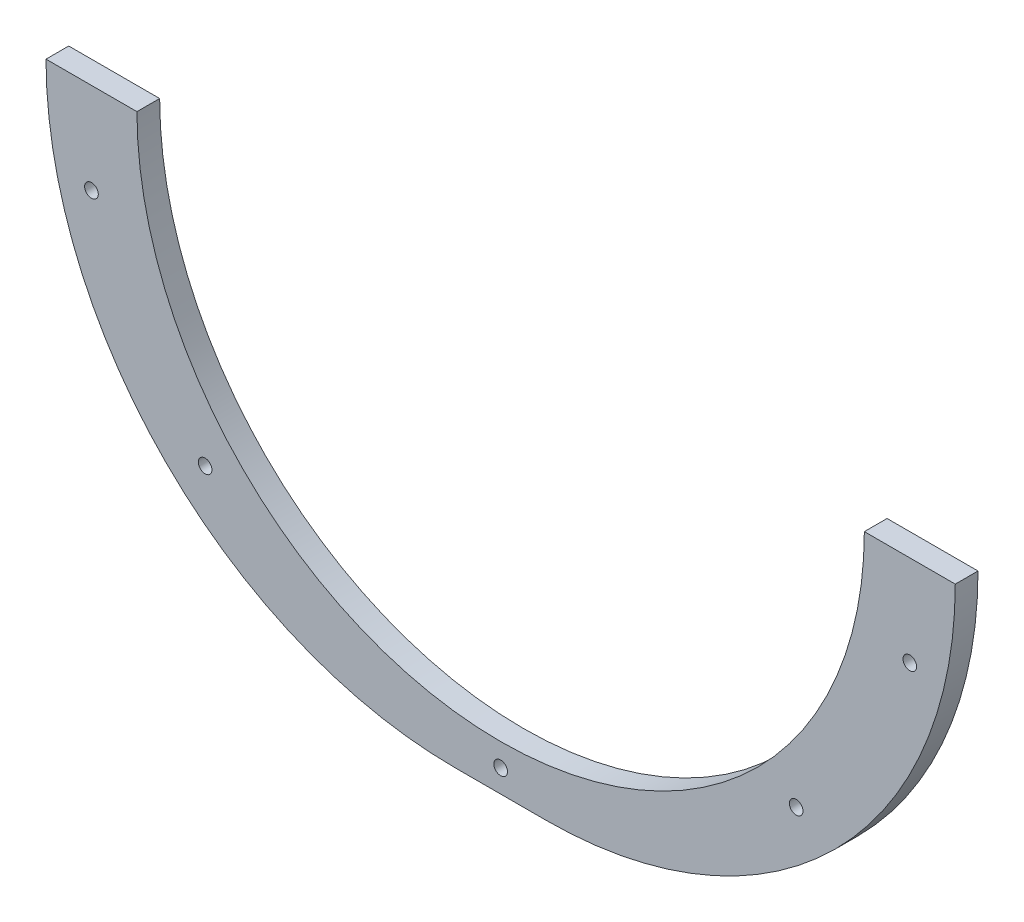
ISO-10303-21;
HEADER;
FILE_DESCRIPTION(('STEP AP214'),'2;1');
FILE_NAME('part.step','',(''),(''),'','','');
FILE_SCHEMA(('AUTOMOTIVE_DESIGN { 1 0 10303 214 1 1 1 1 }'));
ENDSEC;
DATA;
#1=APPLICATION_CONTEXT('core data for automotive mechanical design processes');
#2=APPLICATION_PROTOCOL_DEFINITION('international standard','automotive_design',2000,#1);
#3=PRODUCT_CONTEXT('',#1,'mechanical');
#4=PRODUCT('Part','Part','',(#3));
#5=PRODUCT_RELATED_PRODUCT_CATEGORY('part','',(#4));
#6=PRODUCT_DEFINITION_FORMATION('','',#4);
#7=PRODUCT_DEFINITION_CONTEXT('part definition',#1,'design');
#8=PRODUCT_DEFINITION('design','',#6,#7);
#9=PRODUCT_DEFINITION_SHAPE('','',#8);
#10=(LENGTH_UNIT() NAMED_UNIT(*) SI_UNIT(.MILLI.,.METRE.));
#11=(NAMED_UNIT(*) PLANE_ANGLE_UNIT() SI_UNIT($,.RADIAN.));
#12=(NAMED_UNIT(*) SI_UNIT($,.STERADIAN.) SOLID_ANGLE_UNIT());
#13=UNCERTAINTY_MEASURE_WITH_UNIT(LENGTH_MEASURE(1.E-05),#10,'distance_accuracy_value','');
#14=(GEOMETRIC_REPRESENTATION_CONTEXT(3) GLOBAL_UNCERTAINTY_ASSIGNED_CONTEXT((#13)) GLOBAL_UNIT_ASSIGNED_CONTEXT((#10,
#11,#12)) REPRESENTATION_CONTEXT('',''));
#15=CARTESIAN_POINT('',(0.,0.,0.));
#16=DIRECTION('',(0.,0.,1.));
#17=DIRECTION('',(1.,0.,0.));
#18=AXIS2_PLACEMENT_3D('',#15,#16,#17);
#19=CARTESIAN_POINT('',(83.4794587716096,-40.7692307692308,5.));
#20=DIRECTION('',(0.,0.,-1.));
#21=DIRECTION('',(-1.,0.,0.));
#22=AXIS2_PLACEMENT_3D('',#19,#20,#21);
#23=CYLINDRICAL_SURFACE('',#22,80.);
#24=CARTESIAN_POINT('',(83.4794587716096,-40.7692307692308,0.));
#25=DIRECTION('',(0.,0.,-1.));
#26=DIRECTION('',(1.,0.,0.));
#27=AXIS2_PLACEMENT_3D('',#24,#25,#26);
#28=CIRCLE('',#27,80.);
#29=CARTESIAN_POINT('',(163.47945877161,-40.7692307692302,0.));
#30=VERTEX_POINT('',#29);
#31=CARTESIAN_POINT('',(3.47945877160956,-40.7692307692306,0.));
#32=VERTEX_POINT('',#31);
#33=EDGE_CURVE('E120',#30,#32,#28,.T.);
#34=ORIENTED_EDGE('',*,*,#33,.T.);
#35=DIRECTION('',(0.,0.,-1.));
#36=VECTOR('',#35,1.);
#37=CARTESIAN_POINT('',(3.47945877160956,-40.7692307692306,5.));
#38=LINE('',#37,#36);
#39=CARTESIAN_POINT('',(3.47945877160956,-40.7692307692306,5.));
#40=VERTEX_POINT('',#39);
#41=EDGE_CURVE('E11',#40,#32,#38,.T.);
#42=ORIENTED_EDGE('',*,*,#41,.F.);
#43=CARTESIAN_POINT('',(83.4794587716096,-40.7692307692308,5.));
#44=DIRECTION('',(0.,0.,-1.));
#45=DIRECTION('',(1.,0.,0.));
#46=AXIS2_PLACEMENT_3D('',#43,#44,#45);
#47=CIRCLE('',#46,80.);
#48=CARTESIAN_POINT('',(163.47945877161,-40.7692307692302,5.));
#49=VERTEX_POINT('',#48);
#50=EDGE_CURVE('E131',#49,#40,#47,.T.);
#51=ORIENTED_EDGE('',*,*,#50,.F.);
#52=DIRECTION('',(0.,0.,-1.));
#53=VECTOR('',#52,1.);
#54=CARTESIAN_POINT('',(163.47945877161,-40.7692307692302,5.));
#55=LINE('',#54,#53);
#56=EDGE_CURVE('E116',#49,#30,#55,.T.);
#57=ORIENTED_EDGE('',*,*,#56,.T.);
#58=EDGE_LOOP('',(#34,#42,#51,#57));
#59=FACE_BOUND('',#58,.T.);
#60=ADVANCED_FACE('F34',(#59),#23,.F.);
#61=CARTESIAN_POINT('',(-16.5205412283876,-40.7692307692302,5.));
#62=DIRECTION('',(0.,-1.,0.));
#63=DIRECTION('',(1.,0.,0.));
#64=AXIS2_PLACEMENT_3D('',#61,#62,#63);
#65=PLANE('',#64);
#66=DIRECTION('',(-1.,0.,0.));
#67=VECTOR('',#66,1.);
#68=CARTESIAN_POINT('',(-16.5205412283876,-40.7692307692302,0.));
#69=LINE('',#68,#67);
#70=CARTESIAN_POINT('',(-16.5205412283876,-40.7692307692308,0.));
#71=VERTEX_POINT('',#70);
#72=EDGE_CURVE('E123',#32,#71,#69,.T.);
#73=ORIENTED_EDGE('',*,*,#72,.T.);
#74=DIRECTION('',(0.,0.,-1.));
#75=VECTOR('',#74,1.);
#76=CARTESIAN_POINT('',(-16.5205412283876,-40.7692307692308,5.));
#77=LINE('',#76,#75);
#78=CARTESIAN_POINT('',(-16.5205412283876,-40.7692307692308,5.));
#79=VERTEX_POINT('',#78);
#80=EDGE_CURVE('E43',#79,#71,#77,.T.);
#81=ORIENTED_EDGE('',*,*,#80,.F.);
#82=DIRECTION('',(-1.,0.,0.));
#83=VECTOR('',#82,1.);
#84=CARTESIAN_POINT('',(-16.5205412283876,-40.7692307692302,5.));
#85=LINE('',#84,#83);
#86=EDGE_CURVE('E89',#40,#79,#85,.T.);
#87=ORIENTED_EDGE('',*,*,#86,.F.);
#88=ORIENTED_EDGE('',*,*,#41,.T.);
#89=EDGE_LOOP('',(#73,#81,#87,#88));
#90=FACE_BOUND('',#89,.T.);
#91=ADVANCED_FACE('F164',(#90),#65,.F.);
#92=CARTESIAN_POINT('',(73.4794587716124,-40.7692307692308,5.));
#93=DIRECTION('',(0.,0.,-1.));
#94=DIRECTION('',(-1.,0.,0.));
#95=AXIS2_PLACEMENT_3D('',#92,#93,#94);
#96=CYLINDRICAL_SURFACE('',#95,90.);
#97=CARTESIAN_POINT('',(73.4794587716124,-40.7692307692308,0.));
#98=DIRECTION('',(0.,0.,1.));
#99=DIRECTION('',(-1.,0.,0.));
#100=AXIS2_PLACEMENT_3D('',#97,#98,#99);
#101=CIRCLE('',#100,90.);
#102=CARTESIAN_POINT('',(73.4794587716133,-130.769230769231,0.));
#103=VERTEX_POINT('',#102);
#104=EDGE_CURVE('E126',#71,#103,#101,.T.);
#105=ORIENTED_EDGE('',*,*,#104,.T.);
#106=DIRECTION('',(0.,0.,-1.));
#107=VECTOR('',#106,1.);
#108=CARTESIAN_POINT('',(73.4794587716133,-130.769230769231,5.));
#109=LINE('',#108,#107);
#110=CARTESIAN_POINT('',(73.4794587716133,-130.769230769231,5.));
#111=VERTEX_POINT('',#110);
#112=EDGE_CURVE('E111',#111,#103,#109,.T.);
#113=ORIENTED_EDGE('',*,*,#112,.F.);
#114=CARTESIAN_POINT('',(73.4794587716124,-40.7692307692308,5.));
#115=DIRECTION('',(0.,0.,1.));
#116=DIRECTION('',(-1.,0.,0.));
#117=AXIS2_PLACEMENT_3D('',#114,#115,#116);
#118=CIRCLE('',#117,90.);
#119=EDGE_CURVE('E102',#79,#111,#118,.T.);
#120=ORIENTED_EDGE('',*,*,#119,.F.);
#121=ORIENTED_EDGE('',*,*,#80,.T.);
#122=EDGE_LOOP('',(#105,#113,#120,#121));
#123=FACE_BOUND('',#122,.T.);
#124=ADVANCED_FACE('F167',(#123),#96,.T.);
#125=CARTESIAN_POINT('',(93.479458771612,-130.769230769231,5.));
#126=DIRECTION('',(0.,1.,0.));
#127=DIRECTION('',(-1.,0.,0.));
#128=AXIS2_PLACEMENT_3D('',#125,#126,#127);
#129=PLANE('',#128);
#130=DIRECTION('',(1.,0.,0.));
#131=VECTOR('',#130,1.);
#132=CARTESIAN_POINT('',(93.479458771612,-130.769230769231,0.));
#133=LINE('',#132,#131);
#134=CARTESIAN_POINT('',(93.479458771612,-130.769230769231,0.));
#135=VERTEX_POINT('',#134);
#136=EDGE_CURVE('E110',#103,#135,#133,.T.);
#137=ORIENTED_EDGE('',*,*,#136,.T.);
#138=DIRECTION('',(0.,0.,-1.));
#139=VECTOR('',#138,1.);
#140=CARTESIAN_POINT('',(93.479458771612,-130.769230769231,5.));
#141=LINE('',#140,#139);
#142=CARTESIAN_POINT('',(93.479458771612,-130.769230769231,5.));
#143=VERTEX_POINT('',#142);
#144=EDGE_CURVE('E107',#143,#135,#141,.T.);
#145=ORIENTED_EDGE('',*,*,#144,.F.);
#146=DIRECTION('',(1.,0.,0.));
#147=VECTOR('',#146,1.);
#148=CARTESIAN_POINT('',(93.479458771612,-130.769230769231,5.));
#149=LINE('',#148,#147);
#150=EDGE_CURVE('E96',#111,#143,#149,.T.);
#151=ORIENTED_EDGE('',*,*,#150,.F.);
#152=ORIENTED_EDGE('',*,*,#112,.T.);
#153=EDGE_LOOP('',(#137,#145,#151,#152));
#154=FACE_BOUND('',#153,.T.);
#155=ADVANCED_FACE('F108',(#154),#129,.F.);
#156=CARTESIAN_POINT('',(93.4794587716123,-40.7692307692307,5.));
#157=DIRECTION('',(0.,0.,-1.));
#158=DIRECTION('',(-1.,0.,0.));
#159=AXIS2_PLACEMENT_3D('',#156,#157,#158);
#160=CYLINDRICAL_SURFACE('',#159,90.);
#161=CARTESIAN_POINT('',(93.4794587716123,-40.7692307692307,0.));
#162=DIRECTION('',(0.,0.,1.));
#163=DIRECTION('',(-1.,0.,0.));
#164=AXIS2_PLACEMENT_3D('',#161,#162,#163);
#165=CIRCLE('',#164,90.);
#166=CARTESIAN_POINT('',(183.479458771612,-40.7692307692301,0.));
#167=VERTEX_POINT('',#166);
#168=EDGE_CURVE('E75',#135,#167,#165,.T.);
#169=ORIENTED_EDGE('',*,*,#168,.T.);
#170=DIRECTION('',(0.,0.,-1.));
#171=VECTOR('',#170,1.);
#172=CARTESIAN_POINT('',(183.479458771612,-40.7692307692301,5.));
#173=LINE('',#172,#171);
#174=CARTESIAN_POINT('',(183.479458771612,-40.7692307692301,5.));
#175=VERTEX_POINT('',#174);
#176=EDGE_CURVE('E112',#175,#167,#173,.T.);
#177=ORIENTED_EDGE('',*,*,#176,.F.);
#178=CARTESIAN_POINT('',(93.4794587716123,-40.7692307692307,5.));
#179=DIRECTION('',(0.,0.,1.));
#180=DIRECTION('',(-1.,0.,0.));
#181=AXIS2_PLACEMENT_3D('',#178,#179,#180);
#182=CIRCLE('',#181,90.);
#183=EDGE_CURVE('E100',#143,#175,#182,.T.);
#184=ORIENTED_EDGE('',*,*,#183,.F.);
#185=ORIENTED_EDGE('',*,*,#144,.T.);
#186=EDGE_LOOP('',(#169,#177,#184,#185));
#187=FACE_BOUND('',#186,.T.);
#188=ADVANCED_FACE('F114',(#187),#160,.T.);
#189=CARTESIAN_POINT('',(163.47945877161,-40.7692307692302,5.));
#190=DIRECTION('',(0.,-1.,0.));
#191=DIRECTION('',(1.,0.,0.));
#192=AXIS2_PLACEMENT_3D('',#189,#190,#191);
#193=PLANE('',#192);
#194=DIRECTION('',(-1.,0.,0.));
#195=VECTOR('',#194,1.);
#196=CARTESIAN_POINT('',(163.47945877161,-40.7692307692302,0.));
#197=LINE('',#196,#195);
#198=EDGE_CURVE('E81',#167,#30,#197,.T.);
#199=ORIENTED_EDGE('',*,*,#198,.T.);
#200=ORIENTED_EDGE('',*,*,#56,.F.);
#201=DIRECTION('',(-1.,0.,0.));
#202=VECTOR('',#201,1.);
#203=CARTESIAN_POINT('',(163.47945877161,-40.7692307692302,5.));
#204=LINE('',#203,#202);
#205=EDGE_CURVE('E52',#175,#49,#204,.T.);
#206=ORIENTED_EDGE('',*,*,#205,.F.);
#207=ORIENTED_EDGE('',*,*,#176,.T.);
#208=EDGE_LOOP('',(#199,#200,#206,#207));
#209=FACE_BOUND('',#208,.T.);
#210=ADVANCED_FACE('F172',(#209),#193,.F.);
#211=CARTESIAN_POINT('',(83.4794587716096,-40.7692307692308,5.));
#212=DIRECTION('',(0.,0.,1.));
#213=DIRECTION('',(1.,0.,0.));
#214=AXIS2_PLACEMENT_3D('',#211,#212,#213);
#215=PLANE('',#214);
#216=CARTESIAN_POINT('',(148.479458771612,-100.769230769231,5.));
#217=DIRECTION('',(0.,0.,1.));
#218=DIRECTION('',(1.,0.,0.));
#219=AXIS2_PLACEMENT_3D('',#216,#217,#218);
#220=CIRCLE('',#219,1.5);
#221=CARTESIAN_POINT('',(149.979458771612,-100.769230769231,5.));
#222=VERTEX_POINT('',#221);
#223=EDGE_CURVE('E144',#222,#222,#220,.T.);
#224=ORIENTED_EDGE('',*,*,#223,.F.);
#225=EDGE_LOOP('',(#224));
#226=FACE_BOUND('',#225,.T.);
#227=CARTESIAN_POINT('',(173.479458771612,-60.7692307692307,5.));
#228=DIRECTION('',(0.,0.,1.));
#229=DIRECTION('',(1.,0.,0.));
#230=AXIS2_PLACEMENT_3D('',#227,#228,#229);
#231=CIRCLE('',#230,1.5);
#232=CARTESIAN_POINT('',(174.979458771612,-60.7692307692307,5.));
#233=VERTEX_POINT('',#232);
#234=EDGE_CURVE('E274',#233,#233,#231,.T.);
#235=ORIENTED_EDGE('',*,*,#234,.F.);
#236=EDGE_LOOP('',(#235));
#237=FACE_BOUND('',#236,.T.);
#238=CARTESIAN_POINT('',(-6.52054122838766,-60.7692307692307,5.));
#239=DIRECTION('',(0.,0.,1.));
#240=DIRECTION('',(-1.,0.,0.));
#241=AXIS2_PLACEMENT_3D('',#238,#239,#240);
#242=CIRCLE('',#241,1.5);
#243=CARTESIAN_POINT('',(-8.02054122838766,-60.7692307692307,5.));
#244=VERTEX_POINT('',#243);
#245=EDGE_CURVE('E277',#244,#244,#242,.T.);
#246=ORIENTED_EDGE('',*,*,#245,.F.);
#247=EDGE_LOOP('',(#246));
#248=FACE_BOUND('',#247,.T.);
#249=CARTESIAN_POINT('',(18.4794587716123,-100.769230769231,5.));
#250=DIRECTION('',(0.,0.,1.));
#251=DIRECTION('',(-1.,0.,0.));
#252=AXIS2_PLACEMENT_3D('',#249,#250,#251);
#253=CIRCLE('',#252,1.5);
#254=CARTESIAN_POINT('',(16.9794587716123,-100.769230769231,5.));
#255=VERTEX_POINT('',#254);
#256=EDGE_CURVE('E159',#255,#255,#253,.T.);
#257=ORIENTED_EDGE('',*,*,#256,.F.);
#258=EDGE_LOOP('',(#257));
#259=FACE_BOUND('',#258,.T.);
#260=CARTESIAN_POINT('',(83.4794587716123,-125.769230769231,5.));
#261=DIRECTION('',(0.,0.,1.));
#262=DIRECTION('',(1.,0.,0.));
#263=AXIS2_PLACEMENT_3D('',#260,#261,#262);
#264=CIRCLE('',#263,1.5);
#265=CARTESIAN_POINT('',(84.9794587716123,-125.769230769231,5.));
#266=VERTEX_POINT('',#265);
#267=EDGE_CURVE('E139',#266,#266,#264,.T.);
#268=ORIENTED_EDGE('',*,*,#267,.F.);
#269=EDGE_LOOP('',(#268));
#270=FACE_BOUND('',#269,.T.);
#271=ORIENTED_EDGE('',*,*,#50,.T.);
#272=ORIENTED_EDGE('',*,*,#86,.T.);
#273=ORIENTED_EDGE('',*,*,#119,.T.);
#274=ORIENTED_EDGE('',*,*,#150,.T.);
#275=ORIENTED_EDGE('',*,*,#183,.T.);
#276=ORIENTED_EDGE('',*,*,#205,.T.);
#277=EDGE_LOOP('',(#271,#272,#273,#274,#275,#276));
#278=FACE_BOUND('',#277,.T.);
#279=ADVANCED_FACE('F98',(#226,#237,#248,#259,#270,#278),#215,.T.);
#280=CARTESIAN_POINT('',(83.4794587716096,-40.7692307692308,0.));
#281=DIRECTION('',(0.,0.,1.));
#282=DIRECTION('',(1.,0.,0.));
#283=AXIS2_PLACEMENT_3D('',#280,#281,#282);
#284=PLANE('',#283);
#285=CARTESIAN_POINT('',(148.479458771612,-100.769230769231,0.));
#286=DIRECTION('',(0.,0.,1.));
#287=DIRECTION('',(1.,0.,0.));
#288=AXIS2_PLACEMENT_3D('',#285,#286,#287);
#289=CIRCLE('',#288,1.5);
#290=CARTESIAN_POINT('',(149.979458771612,-100.769230769231,0.));
#291=VERTEX_POINT('',#290);
#292=EDGE_CURVE('E37',#291,#291,#289,.T.);
#293=ORIENTED_EDGE('',*,*,#292,.T.);
#294=EDGE_LOOP('',(#293));
#295=FACE_BOUND('',#294,.T.);
#296=CARTESIAN_POINT('',(173.479458771612,-60.7692307692307,0.));
#297=DIRECTION('',(0.,0.,1.));
#298=DIRECTION('',(1.,0.,0.));
#299=AXIS2_PLACEMENT_3D('',#296,#297,#298);
#300=CIRCLE('',#299,1.5);
#301=CARTESIAN_POINT('',(174.979458771612,-60.7692307692307,0.));
#302=VERTEX_POINT('',#301);
#303=EDGE_CURVE('E146',#302,#302,#300,.T.);
#304=ORIENTED_EDGE('',*,*,#303,.T.);
#305=EDGE_LOOP('',(#304));
#306=FACE_BOUND('',#305,.T.);
#307=CARTESIAN_POINT('',(-6.52054122838766,-60.7692307692307,0.));
#308=DIRECTION('',(0.,0.,1.));
#309=DIRECTION('',(1.,0.,0.));
#310=AXIS2_PLACEMENT_3D('',#307,#308,#309);
#311=CIRCLE('',#310,1.5);
#312=CARTESIAN_POINT('',(-5.02054122838766,-60.7692307692307,0.));
#313=VERTEX_POINT('',#312);
#314=EDGE_CURVE('E143',#313,#313,#311,.T.);
#315=ORIENTED_EDGE('',*,*,#314,.T.);
#316=EDGE_LOOP('',(#315));
#317=FACE_BOUND('',#316,.T.);
#318=CARTESIAN_POINT('',(18.4794587716123,-100.769230769231,0.));
#319=DIRECTION('',(0.,0.,1.));
#320=DIRECTION('',(1.,0.,0.));
#321=AXIS2_PLACEMENT_3D('',#318,#319,#320);
#322=CIRCLE('',#321,1.5);
#323=CARTESIAN_POINT('',(19.9794587716123,-100.769230769231,0.));
#324=VERTEX_POINT('',#323);
#325=EDGE_CURVE('E140',#324,#324,#322,.T.);
#326=ORIENTED_EDGE('',*,*,#325,.T.);
#327=EDGE_LOOP('',(#326));
#328=FACE_BOUND('',#327,.T.);
#329=CARTESIAN_POINT('',(83.4794587716123,-125.769230769231,0.));
#330=DIRECTION('',(0.,0.,1.));
#331=DIRECTION('',(1.,0.,0.));
#332=AXIS2_PLACEMENT_3D('',#329,#330,#331);
#333=CIRCLE('',#332,1.5);
#334=CARTESIAN_POINT('',(84.9794587716123,-125.769230769231,0.));
#335=VERTEX_POINT('',#334);
#336=EDGE_CURVE('E124',#335,#335,#333,.T.);
#337=ORIENTED_EDGE('',*,*,#336,.T.);
#338=EDGE_LOOP('',(#337));
#339=FACE_BOUND('',#338,.T.);
#340=ORIENTED_EDGE('',*,*,#33,.F.);
#341=ORIENTED_EDGE('',*,*,#198,.F.);
#342=ORIENTED_EDGE('',*,*,#168,.F.);
#343=ORIENTED_EDGE('',*,*,#136,.F.);
#344=ORIENTED_EDGE('',*,*,#104,.F.);
#345=ORIENTED_EDGE('',*,*,#72,.F.);
#346=EDGE_LOOP('',(#340,#341,#342,#343,#344,#345));
#347=FACE_BOUND('',#346,.T.);
#348=ADVANCED_FACE('F170',(#295,#306,#317,#328,#339,#347),#284,.F.);
#349=CARTESIAN_POINT('',(83.4794587716123,-125.769230769231,-5.));
#350=DIRECTION('',(0.,0.,1.));
#351=DIRECTION('',(1.,0.,0.));
#352=AXIS2_PLACEMENT_3D('',#349,#350,#351);
#353=CYLINDRICAL_SURFACE('',#352,1.5);
#354=ORIENTED_EDGE('',*,*,#267,.T.);
#355=EDGE_LOOP('',(#354));
#356=FACE_BOUND('',#355,.T.);
#357=ORIENTED_EDGE('',*,*,#336,.F.);
#358=EDGE_LOOP('',(#357));
#359=FACE_BOUND('',#358,.T.);
#360=ADVANCED_FACE('F220',(#356,#359),#353,.F.);
#361=CARTESIAN_POINT('',(18.4794587716123,-100.769230769231,-5.));
#362=DIRECTION('',(0.,0.,1.));
#363=DIRECTION('',(1.,0.,0.));
#364=AXIS2_PLACEMENT_3D('',#361,#362,#363);
#365=CYLINDRICAL_SURFACE('',#364,1.5);
#366=ORIENTED_EDGE('',*,*,#256,.T.);
#367=EDGE_LOOP('',(#366));
#368=FACE_BOUND('',#367,.T.);
#369=ORIENTED_EDGE('',*,*,#325,.F.);
#370=EDGE_LOOP('',(#369));
#371=FACE_BOUND('',#370,.T.);
#372=ADVANCED_FACE('F228',(#368,#371),#365,.F.);
#373=CARTESIAN_POINT('',(-6.52054122838766,-60.7692307692307,-5.));
#374=DIRECTION('',(0.,0.,1.));
#375=DIRECTION('',(1.,0.,0.));
#376=AXIS2_PLACEMENT_3D('',#373,#374,#375);
#377=CYLINDRICAL_SURFACE('',#376,1.5);
#378=ORIENTED_EDGE('',*,*,#245,.T.);
#379=EDGE_LOOP('',(#378));
#380=FACE_BOUND('',#379,.T.);
#381=ORIENTED_EDGE('',*,*,#314,.F.);
#382=EDGE_LOOP('',(#381));
#383=FACE_BOUND('',#382,.T.);
#384=ADVANCED_FACE('F237',(#380,#383),#377,.F.);
#385=CARTESIAN_POINT('',(173.479458771612,-60.7692307692307,-5.));
#386=DIRECTION('',(0.,0.,1.));
#387=DIRECTION('',(1.,0.,0.));
#388=AXIS2_PLACEMENT_3D('',#385,#386,#387);
#389=CYLINDRICAL_SURFACE('',#388,1.5);
#390=ORIENTED_EDGE('',*,*,#234,.T.);
#391=EDGE_LOOP('',(#390));
#392=FACE_BOUND('',#391,.T.);
#393=ORIENTED_EDGE('',*,*,#303,.F.);
#394=EDGE_LOOP('',(#393));
#395=FACE_BOUND('',#394,.T.);
#396=ADVANCED_FACE('F247',(#392,#395),#389,.F.);
#397=CARTESIAN_POINT('',(148.479458771612,-100.769230769231,-5.));
#398=DIRECTION('',(0.,0.,1.));
#399=DIRECTION('',(1.,0.,0.));
#400=AXIS2_PLACEMENT_3D('',#397,#398,#399);
#401=CYLINDRICAL_SURFACE('',#400,1.5);
#402=ORIENTED_EDGE('',*,*,#223,.T.);
#403=EDGE_LOOP('',(#402));
#404=FACE_BOUND('',#403,.T.);
#405=ORIENTED_EDGE('',*,*,#292,.F.);
#406=EDGE_LOOP('',(#405));
#407=FACE_BOUND('',#406,.T.);
#408=ADVANCED_FACE('F257',(#404,#407),#401,.F.);
#409=CLOSED_SHELL('',(#60,#91,#124,#155,#188,#210,#279,#348,#360,#372,#384,#396,#408));
#410=MANIFOLD_SOLID_BREP('B2',#409);
#411=ADVANCED_BREP_SHAPE_REPRESENTATION('',(#18,#410),#14);
#412=SHAPE_DEFINITION_REPRESENTATION(#9,#411);
ENDSEC;
END-ISO-10303-21;
